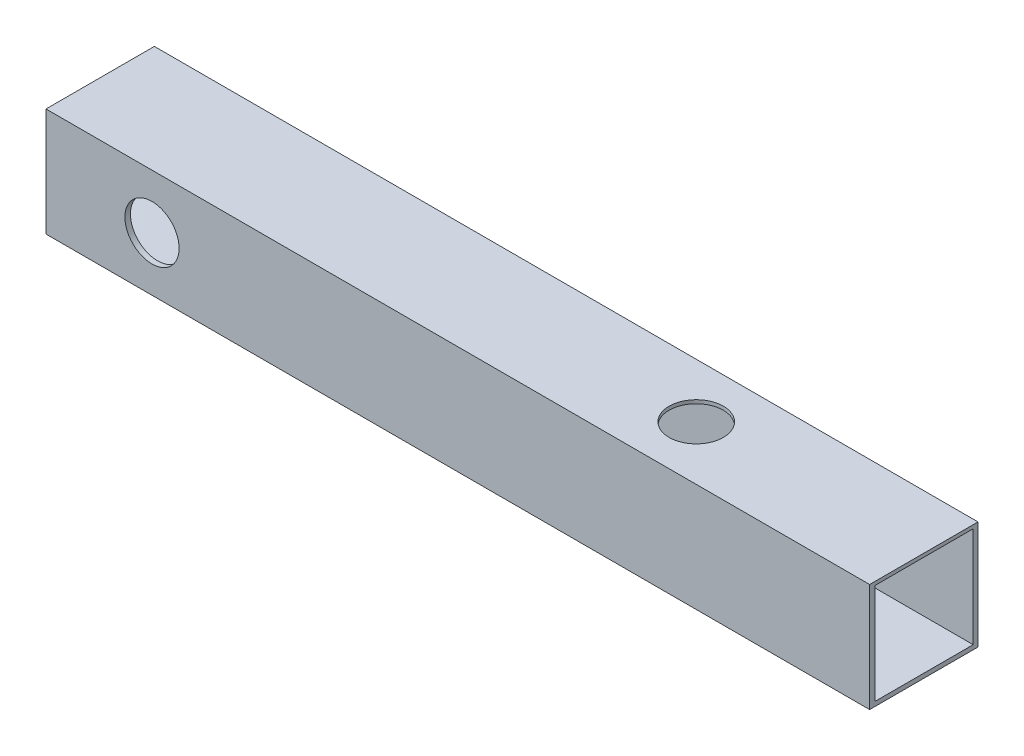
ISO-10303-21;
HEADER;
FILE_DESCRIPTION(('STEP AP214'),'2;1');
FILE_NAME('part.step','',(''),(''),'','','');
FILE_SCHEMA(('AUTOMOTIVE_DESIGN { 1 0 10303 214 1 1 1 1 }'));
ENDSEC;
DATA;
#1=APPLICATION_CONTEXT('core data for automotive mechanical design processes');
#2=APPLICATION_PROTOCOL_DEFINITION('international standard','automotive_design',2000,#1);
#3=PRODUCT_CONTEXT('',#1,'mechanical');
#4=PRODUCT('Part','Part','',(#3));
#5=PRODUCT_RELATED_PRODUCT_CATEGORY('part','',(#4));
#6=PRODUCT_DEFINITION_FORMATION('','',#4);
#7=PRODUCT_DEFINITION_CONTEXT('part definition',#1,'design');
#8=PRODUCT_DEFINITION('design','',#6,#7);
#9=PRODUCT_DEFINITION_SHAPE('','',#8);
#10=(LENGTH_UNIT() NAMED_UNIT(*) SI_UNIT(.MILLI.,.METRE.));
#11=(NAMED_UNIT(*) PLANE_ANGLE_UNIT() SI_UNIT($,.RADIAN.));
#12=(NAMED_UNIT(*) SI_UNIT($,.STERADIAN.) SOLID_ANGLE_UNIT());
#13=UNCERTAINTY_MEASURE_WITH_UNIT(LENGTH_MEASURE(1.E-05),#10,'distance_accuracy_value','');
#14=(GEOMETRIC_REPRESENTATION_CONTEXT(3) GLOBAL_UNCERTAINTY_ASSIGNED_CONTEXT((#13)) GLOBAL_UNIT_ASSIGNED_CONTEXT((#10,
#11,#12)) REPRESENTATION_CONTEXT('',''));
#15=CARTESIAN_POINT('',(0.,0.,0.));
#16=DIRECTION('',(0.,0.,1.));
#17=DIRECTION('',(1.,0.,0.));
#18=AXIS2_PLACEMENT_3D('',#15,#16,#17);
#19=CARTESIAN_POINT('',(38.,10.,-5.));
#20=DIRECTION('',(-1.,0.,0.));
#21=DIRECTION('',(0.,0.,1.));
#22=AXIS2_PLACEMENT_3D('',#19,#20,#21);
#23=PLANE('',#22);
#24=DIRECTION('',(0.,0.,1.));
#25=VECTOR('',#24,1.);
#26=CARTESIAN_POINT('',(38.,0.410528979839953,-4.55573386053487));
#27=LINE('',#26,#25);
#28=CARTESIAN_POINT('',(38.,0.410528979839953,-4.55573386053487));
#29=VERTEX_POINT('',#28);
#30=CARTESIAN_POINT('',(38.,0.410528979839953,4.49074897210089));
#31=VERTEX_POINT('',#30);
#32=EDGE_CURVE('E115',#29,#31,#27,.T.);
#33=ORIENTED_EDGE('',*,*,#32,.T.);
#34=DIRECTION('',(0.,1.,0.));
#35=VECTOR('',#34,1.);
#36=CARTESIAN_POINT('',(38.,0.410528979839953,4.49074897210089));
#37=LINE('',#36,#35);
#38=CARTESIAN_POINT('',(38.,9.67445186257176,4.49074897210089));
#39=VERTEX_POINT('',#38);
#40=EDGE_CURVE('E108',#31,#39,#37,.T.);
#41=ORIENTED_EDGE('',*,*,#40,.T.);
#42=DIRECTION('',(0.,0.,-1.));
#43=VECTOR('',#42,1.);
#44=CARTESIAN_POINT('',(38.,9.67445186257176,-4.55573386053487));
#45=LINE('',#44,#43);
#46=CARTESIAN_POINT('',(38.,9.67445186257176,-4.55573386053487));
#47=VERTEX_POINT('',#46);
#48=EDGE_CURVE('E118',#39,#47,#45,.T.);
#49=ORIENTED_EDGE('',*,*,#48,.T.);
#50=DIRECTION('',(0.,-1.,0.));
#51=VECTOR('',#50,1.);
#52=CARTESIAN_POINT('',(38.,0.410528979839953,-4.55573386053487));
#53=LINE('',#52,#51);
#54=EDGE_CURVE('E56',#47,#29,#53,.T.);
#55=ORIENTED_EDGE('',*,*,#54,.T.);
#56=EDGE_LOOP('',(#33,#41,#49,#55));
#57=FACE_BOUND('',#56,.T.);
#58=DIRECTION('',(0.,0.,-1.));
#59=VECTOR('',#58,1.);
#60=CARTESIAN_POINT('',(38.,0.,-5.));
#61=LINE('',#60,#59);
#62=CARTESIAN_POINT('',(38.,0.,5.));
#63=VERTEX_POINT('',#62);
#64=CARTESIAN_POINT('',(38.,0.,-5.));
#65=VERTEX_POINT('',#64);
#66=EDGE_CURVE('E151',#63,#65,#61,.T.);
#67=ORIENTED_EDGE('',*,*,#66,.T.);
#68=DIRECTION('',(0.,-1.,0.));
#69=VECTOR('',#68,1.);
#70=CARTESIAN_POINT('',(38.,10.,-5.));
#71=LINE('',#70,#69);
#72=CARTESIAN_POINT('',(38.,10.,-5.));
#73=VERTEX_POINT('',#72);
#74=EDGE_CURVE('E11',#73,#65,#71,.T.);
#75=ORIENTED_EDGE('',*,*,#74,.F.);
#76=DIRECTION('',(0.,0.,-1.));
#77=VECTOR('',#76,1.);
#78=CARTESIAN_POINT('',(38.,10.,-5.));
#79=LINE('',#78,#77);
#80=CARTESIAN_POINT('',(38.,10.,5.));
#81=VERTEX_POINT('',#80);
#82=EDGE_CURVE('E157',#81,#73,#79,.T.);
#83=ORIENTED_EDGE('',*,*,#82,.F.);
#84=DIRECTION('',(0.,-1.,0.));
#85=VECTOR('',#84,1.);
#86=CARTESIAN_POINT('',(38.,10.,5.));
#87=LINE('',#86,#85);
#88=EDGE_CURVE('E171',#81,#63,#87,.T.);
#89=ORIENTED_EDGE('',*,*,#88,.T.);
#90=EDGE_LOOP('',(#67,#75,#83,#89));
#91=FACE_BOUND('',#90,.T.);
#92=ADVANCED_FACE('F39',(#57,#91),#23,.F.);
#93=CARTESIAN_POINT('',(-38.,10.,-5.));
#94=DIRECTION('',(0.,0.,1.));
#95=DIRECTION('',(1.,0.,0.));
#96=AXIS2_PLACEMENT_3D('',#93,#94,#95);
#97=PLANE('',#96);
#98=CARTESIAN_POINT('',(-28.218728933674,5.,-5.));
#99=DIRECTION('',(0.,0.,1.));
#100=DIRECTION('',(1.,0.,0.));
#101=AXIS2_PLACEMENT_3D('',#98,#99,#100);
#102=CIRCLE('',#101,2.5);
#103=CARTESIAN_POINT('',(-25.718728933674,5.,-5.));
#104=VERTEX_POINT('',#103);
#105=EDGE_CURVE('E133',#104,#104,#102,.T.);
#106=ORIENTED_EDGE('',*,*,#105,.T.);
#107=EDGE_LOOP('',(#106));
#108=FACE_BOUND('',#107,.T.);
#109=DIRECTION('',(-1.,0.,0.));
#110=VECTOR('',#109,1.);
#111=CARTESIAN_POINT('',(-38.,0.,-5.));
#112=LINE('',#111,#110);
#113=CARTESIAN_POINT('',(-38.,0.,-5.));
#114=VERTEX_POINT('',#113);
#115=EDGE_CURVE('E175',#65,#114,#112,.T.);
#116=ORIENTED_EDGE('',*,*,#115,.T.);
#117=DIRECTION('',(0.,-1.,0.));
#118=VECTOR('',#117,1.);
#119=CARTESIAN_POINT('',(-38.,10.,-5.));
#120=LINE('',#119,#118);
#121=CARTESIAN_POINT('',(-38.,10.,-5.));
#122=VERTEX_POINT('',#121);
#123=EDGE_CURVE('E48',#122,#114,#120,.T.);
#124=ORIENTED_EDGE('',*,*,#123,.F.);
#125=DIRECTION('',(-1.,0.,0.));
#126=VECTOR('',#125,1.);
#127=CARTESIAN_POINT('',(-38.,10.,-5.));
#128=LINE('',#127,#126);
#129=EDGE_CURVE('E161',#73,#122,#128,.T.);
#130=ORIENTED_EDGE('',*,*,#129,.F.);
#131=ORIENTED_EDGE('',*,*,#74,.T.);
#132=EDGE_LOOP('',(#116,#124,#130,#131));
#133=FACE_BOUND('',#132,.T.);
#134=ADVANCED_FACE('F238',(#108,#133),#97,.F.);
#135=CARTESIAN_POINT('',(-38.,10.,-5.));
#136=DIRECTION('',(1.,0.,0.));
#137=DIRECTION('',(0.,0.,-1.));
#138=AXIS2_PLACEMENT_3D('',#135,#136,#137);
#139=PLANE('',#138);
#140=DIRECTION('',(0.,0.,-1.));
#141=VECTOR('',#140,1.);
#142=CARTESIAN_POINT('',(-38.,9.67445186257176,-4.55573386053487));
#143=LINE('',#142,#141);
#144=CARTESIAN_POINT('',(-38.,9.67445186257176,4.49074897210089));
#145=VERTEX_POINT('',#144);
#146=CARTESIAN_POINT('',(-38.,9.67445186257176,-4.55573386053487));
#147=VERTEX_POINT('',#146);
#148=EDGE_CURVE('E142',#145,#147,#143,.T.);
#149=ORIENTED_EDGE('',*,*,#148,.F.);
#150=DIRECTION('',(0.,1.,0.));
#151=VECTOR('',#150,1.);
#152=CARTESIAN_POINT('',(-38.,0.410528979839953,4.49074897210089));
#153=LINE('',#152,#151);
#154=CARTESIAN_POINT('',(-38.,0.410528979839953,4.49074897210089));
#155=VERTEX_POINT('',#154);
#156=EDGE_CURVE('E64',#155,#145,#153,.T.);
#157=ORIENTED_EDGE('',*,*,#156,.F.);
#158=DIRECTION('',(0.,0.,1.));
#159=VECTOR('',#158,1.);
#160=CARTESIAN_POINT('',(-38.,0.410528979839953,-4.55573386053487));
#161=LINE('',#160,#159);
#162=CARTESIAN_POINT('',(-38.,0.410528979839953,-4.55573386053487));
#163=VERTEX_POINT('',#162);
#164=EDGE_CURVE('E126',#163,#155,#161,.T.);
#165=ORIENTED_EDGE('',*,*,#164,.F.);
#166=DIRECTION('',(0.,-1.,0.));
#167=VECTOR('',#166,1.);
#168=CARTESIAN_POINT('',(-38.,0.410528979839953,-4.55573386053487));
#169=LINE('',#168,#167);
#170=EDGE_CURVE('E130',#147,#163,#169,.T.);
#171=ORIENTED_EDGE('',*,*,#170,.F.);
#172=EDGE_LOOP('',(#149,#157,#165,#171));
#173=FACE_BOUND('',#172,.T.);
#174=DIRECTION('',(0.,0.,1.));
#175=VECTOR('',#174,1.);
#176=CARTESIAN_POINT('',(-38.,0.,-5.));
#177=LINE('',#176,#175);
#178=CARTESIAN_POINT('',(-38.,0.,5.));
#179=VERTEX_POINT('',#178);
#180=EDGE_CURVE('E178',#114,#179,#177,.T.);
#181=ORIENTED_EDGE('',*,*,#180,.T.);
#182=DIRECTION('',(0.,-1.,0.));
#183=VECTOR('',#182,1.);
#184=CARTESIAN_POINT('',(-38.,10.,5.));
#185=LINE('',#184,#183);
#186=CARTESIAN_POINT('',(-38.,10.,5.));
#187=VERTEX_POINT('',#186);
#188=EDGE_CURVE('E186',#187,#179,#185,.T.);
#189=ORIENTED_EDGE('',*,*,#188,.F.);
#190=DIRECTION('',(0.,0.,1.));
#191=VECTOR('',#190,1.);
#192=CARTESIAN_POINT('',(-38.,10.,-5.));
#193=LINE('',#192,#191);
#194=EDGE_CURVE('E165',#122,#187,#193,.T.);
#195=ORIENTED_EDGE('',*,*,#194,.F.);
#196=ORIENTED_EDGE('',*,*,#123,.T.);
#197=EDGE_LOOP('',(#181,#189,#195,#196));
#198=FACE_BOUND('',#197,.T.);
#199=ADVANCED_FACE('F242',(#173,#198),#139,.F.);
#200=CARTESIAN_POINT('',(-38.,10.,5.));
#201=DIRECTION('',(0.,0.,-1.));
#202=DIRECTION('',(-1.,0.,0.));
#203=AXIS2_PLACEMENT_3D('',#200,#201,#202);
#204=PLANE('',#203);
#205=CARTESIAN_POINT('',(-28.218728933674,5.,5.));
#206=DIRECTION('',(0.,0.,1.));
#207=DIRECTION('',(1.,0.,0.));
#208=AXIS2_PLACEMENT_3D('',#205,#206,#207);
#209=CIRCLE('',#208,2.5);
#210=CARTESIAN_POINT('',(-25.718728933674,5.,5.));
#211=VERTEX_POINT('',#210);
#212=EDGE_CURVE('E196',#211,#211,#209,.T.);
#213=ORIENTED_EDGE('',*,*,#212,.F.);
#214=EDGE_LOOP('',(#213));
#215=FACE_BOUND('',#214,.T.);
#216=DIRECTION('',(1.,0.,0.));
#217=VECTOR('',#216,1.);
#218=CARTESIAN_POINT('',(-38.,0.,5.));
#219=LINE('',#218,#217);
#220=EDGE_CURVE('E162',#179,#63,#219,.T.);
#221=ORIENTED_EDGE('',*,*,#220,.T.);
#222=ORIENTED_EDGE('',*,*,#88,.F.);
#223=DIRECTION('',(1.,0.,0.));
#224=VECTOR('',#223,1.);
#225=CARTESIAN_POINT('',(-38.,10.,5.));
#226=LINE('',#225,#224);
#227=EDGE_CURVE('E168',#187,#81,#226,.T.);
#228=ORIENTED_EDGE('',*,*,#227,.F.);
#229=ORIENTED_EDGE('',*,*,#188,.T.);
#230=EDGE_LOOP('',(#221,#222,#228,#229));
#231=FACE_BOUND('',#230,.T.);
#232=ADVANCED_FACE('F247',(#215,#231),#204,.F.);
#233=CARTESIAN_POINT('',(0.,10.,0.));
#234=DIRECTION('',(0.,1.,0.));
#235=DIRECTION('',(0.,0.,1.));
#236=AXIS2_PLACEMENT_3D('',#233,#234,#235);
#237=PLANE('',#236);
#238=CARTESIAN_POINT('',(17.,10.,0.));
#239=DIRECTION('',(0.,1.,0.));
#240=DIRECTION('',(0.,0.,1.));
#241=AXIS2_PLACEMENT_3D('',#238,#239,#240);
#242=CIRCLE('',#241,2.5);
#243=CARTESIAN_POINT('',(17.,10.,2.5));
#244=VERTEX_POINT('',#243);
#245=EDGE_CURVE('E215',#244,#244,#242,.T.);
#246=ORIENTED_EDGE('',*,*,#245,.F.);
#247=EDGE_LOOP('',(#246));
#248=FACE_BOUND('',#247,.T.);
#249=ORIENTED_EDGE('',*,*,#82,.T.);
#250=ORIENTED_EDGE('',*,*,#129,.T.);
#251=ORIENTED_EDGE('',*,*,#194,.T.);
#252=ORIENTED_EDGE('',*,*,#227,.T.);
#253=EDGE_LOOP('',(#249,#250,#251,#252));
#254=FACE_BOUND('',#253,.T.);
#255=ADVANCED_FACE('F255',(#248,#254),#237,.T.);
#256=CARTESIAN_POINT('',(0.,0.,0.));
#257=DIRECTION('',(0.,1.,0.));
#258=DIRECTION('',(0.,0.,1.));
#259=AXIS2_PLACEMENT_3D('',#256,#257,#258);
#260=PLANE('',#259);
#261=CARTESIAN_POINT('',(17.,0.,0.));
#262=DIRECTION('',(0.,1.,0.));
#263=DIRECTION('',(0.,0.,1.));
#264=AXIS2_PLACEMENT_3D('',#261,#262,#263);
#265=CIRCLE('',#264,2.5);
#266=CARTESIAN_POINT('',(17.,0.,2.5));
#267=VERTEX_POINT('',#266);
#268=EDGE_CURVE('E203',#267,#267,#265,.T.);
#269=ORIENTED_EDGE('',*,*,#268,.T.);
#270=EDGE_LOOP('',(#269));
#271=FACE_BOUND('',#270,.T.);
#272=ORIENTED_EDGE('',*,*,#66,.F.);
#273=ORIENTED_EDGE('',*,*,#220,.F.);
#274=ORIENTED_EDGE('',*,*,#180,.F.);
#275=ORIENTED_EDGE('',*,*,#115,.F.);
#276=EDGE_LOOP('',(#272,#273,#274,#275));
#277=FACE_BOUND('',#276,.T.);
#278=ADVANCED_FACE('F257',(#271,#277),#260,.F.);
#279=CARTESIAN_POINT('',(38.,0.410528979839953,4.49074897210089));
#280=DIRECTION('',(0.,0.,1.));
#281=DIRECTION('',(1.,0.,0.));
#282=AXIS2_PLACEMENT_3D('',#279,#280,#281);
#283=PLANE('',#282);
#284=CARTESIAN_POINT('',(-28.218728933674,5.,4.49074897210089));
#285=DIRECTION('',(0.,0.,1.));
#286=DIRECTION('',(1.,0.,0.));
#287=AXIS2_PLACEMENT_3D('',#284,#285,#286);
#288=CIRCLE('',#287,2.5);
#289=CARTESIAN_POINT('',(-25.718728933674,5.,4.49074897210089));
#290=VERTEX_POINT('',#289);
#291=EDGE_CURVE('E195',#290,#290,#288,.T.);
#292=ORIENTED_EDGE('',*,*,#291,.T.);
#293=EDGE_LOOP('',(#292));
#294=FACE_BOUND('',#293,.T.);
#295=ORIENTED_EDGE('',*,*,#156,.T.);
#296=DIRECTION('',(-1.,0.,0.));
#297=VECTOR('',#296,1.);
#298=CARTESIAN_POINT('',(38.,9.67445186257176,4.49074897210089));
#299=LINE('',#298,#297);
#300=EDGE_CURVE('E104',#39,#145,#299,.T.);
#301=ORIENTED_EDGE('',*,*,#300,.F.);
#302=ORIENTED_EDGE('',*,*,#40,.F.);
#303=DIRECTION('',(-1.,0.,0.));
#304=VECTOR('',#303,1.);
#305=CARTESIAN_POINT('',(38.,0.410528979839953,4.49074897210089));
#306=LINE('',#305,#304);
#307=EDGE_CURVE('E148',#31,#155,#306,.T.);
#308=ORIENTED_EDGE('',*,*,#307,.T.);
#309=EDGE_LOOP('',(#295,#301,#302,#308));
#310=FACE_BOUND('',#309,.T.);
#311=ADVANCED_FACE('F106',(#294,#310),#283,.F.);
#312=CARTESIAN_POINT('',(38.,0.410528979839953,-4.55573386053487));
#313=DIRECTION('',(0.,-1.,0.));
#314=DIRECTION('',(0.,0.,-1.));
#315=AXIS2_PLACEMENT_3D('',#312,#313,#314);
#316=PLANE('',#315);
#317=CARTESIAN_POINT('',(17.,0.410528979839953,0.));
#318=DIRECTION('',(0.,-1.,0.));
#319=DIRECTION('',(0.,0.,-1.));
#320=AXIS2_PLACEMENT_3D('',#317,#318,#319);
#321=CIRCLE('',#320,2.5);
#322=CARTESIAN_POINT('',(17.,0.410528979839953,-2.5));
#323=VERTEX_POINT('',#322);
#324=EDGE_CURVE('E209',#323,#323,#321,.T.);
#325=ORIENTED_EDGE('',*,*,#324,.T.);
#326=EDGE_LOOP('',(#325));
#327=FACE_BOUND('',#326,.T.);
#328=ORIENTED_EDGE('',*,*,#164,.T.);
#329=ORIENTED_EDGE('',*,*,#307,.F.);
#330=ORIENTED_EDGE('',*,*,#32,.F.);
#331=DIRECTION('',(-1.,0.,0.));
#332=VECTOR('',#331,1.);
#333=CARTESIAN_POINT('',(38.,0.410528979839953,-4.55573386053487));
#334=LINE('',#333,#332);
#335=EDGE_CURVE('E152',#29,#163,#334,.T.);
#336=ORIENTED_EDGE('',*,*,#335,.T.);
#337=EDGE_LOOP('',(#328,#329,#330,#336));
#338=FACE_BOUND('',#337,.T.);
#339=ADVANCED_FACE('F266',(#327,#338),#316,.F.);
#340=CARTESIAN_POINT('',(38.,0.410528979839953,-4.55573386053487));
#341=DIRECTION('',(0.,0.,-1.));
#342=DIRECTION('',(-1.,0.,0.));
#343=AXIS2_PLACEMENT_3D('',#340,#341,#342);
#344=PLANE('',#343);
#345=CARTESIAN_POINT('',(-28.218728933674,5.,-4.55573386053487));
#346=DIRECTION('',(0.,0.,-1.));
#347=DIRECTION('',(-1.,0.,0.));
#348=AXIS2_PLACEMENT_3D('',#345,#346,#347);
#349=CIRCLE('',#348,2.5);
#350=CARTESIAN_POINT('',(-30.718728933674,5.,-4.55573386053487));
#351=VERTEX_POINT('',#350);
#352=EDGE_CURVE('E192',#351,#351,#349,.T.);
#353=ORIENTED_EDGE('',*,*,#352,.T.);
#354=EDGE_LOOP('',(#353));
#355=FACE_BOUND('',#354,.T.);
#356=ORIENTED_EDGE('',*,*,#170,.T.);
#357=ORIENTED_EDGE('',*,*,#335,.F.);
#358=ORIENTED_EDGE('',*,*,#54,.F.);
#359=DIRECTION('',(-1.,0.,0.));
#360=VECTOR('',#359,1.);
#361=CARTESIAN_POINT('',(38.,9.67445186257176,-4.55573386053487));
#362=LINE('',#361,#360);
#363=EDGE_CURVE('E114',#47,#147,#362,.T.);
#364=ORIENTED_EDGE('',*,*,#363,.T.);
#365=EDGE_LOOP('',(#356,#357,#358,#364));
#366=FACE_BOUND('',#365,.T.);
#367=ADVANCED_FACE('F270',(#355,#366),#344,.F.);
#368=CARTESIAN_POINT('',(38.,9.67445186257176,-4.55573386053487));
#369=DIRECTION('',(0.,1.,0.));
#370=DIRECTION('',(0.,0.,1.));
#371=AXIS2_PLACEMENT_3D('',#368,#369,#370);
#372=PLANE('',#371);
#373=CARTESIAN_POINT('',(17.,9.67445186257176,0.));
#374=DIRECTION('',(0.,1.,0.));
#375=DIRECTION('',(0.,0.,1.));
#376=AXIS2_PLACEMENT_3D('',#373,#374,#375);
#377=CIRCLE('',#376,2.5);
#378=CARTESIAN_POINT('',(17.,9.67445186257176,2.5));
#379=VERTEX_POINT('',#378);
#380=EDGE_CURVE('E42',#379,#379,#377,.T.);
#381=ORIENTED_EDGE('',*,*,#380,.T.);
#382=EDGE_LOOP('',(#381));
#383=FACE_BOUND('',#382,.T.);
#384=ORIENTED_EDGE('',*,*,#148,.T.);
#385=ORIENTED_EDGE('',*,*,#363,.F.);
#386=ORIENTED_EDGE('',*,*,#48,.F.);
#387=ORIENTED_EDGE('',*,*,#300,.T.);
#388=EDGE_LOOP('',(#384,#385,#386,#387));
#389=FACE_BOUND('',#388,.T.);
#390=ADVANCED_FACE('F119',(#383,#389),#372,.F.);
#391=CARTESIAN_POINT('',(-28.218728933674,5.,-71.));
#392=DIRECTION('',(0.,0.,1.));
#393=DIRECTION('',(1.,0.,0.));
#394=AXIS2_PLACEMENT_3D('',#391,#392,#393);
#395=CYLINDRICAL_SURFACE('',#394,2.5);
#396=ORIENTED_EDGE('',*,*,#352,.F.);
#397=EDGE_LOOP('',(#396));
#398=FACE_BOUND('',#397,.T.);
#399=ORIENTED_EDGE('',*,*,#105,.F.);
#400=EDGE_LOOP('',(#399));
#401=FACE_BOUND('',#400,.T.);
#402=ADVANCED_FACE('F235',(#398,#401),#395,.F.);
#403=ORIENTED_EDGE('',*,*,#212,.T.);
#404=EDGE_LOOP('',(#403));
#405=FACE_BOUND('',#404,.T.);
#406=ORIENTED_EDGE('',*,*,#291,.F.);
#407=EDGE_LOOP('',(#406));
#408=FACE_BOUND('',#407,.T.);
#409=ADVANCED_FACE('F228',(#405,#408),#395,.F.);
#410=CARTESIAN_POINT('',(17.,-66.,0.));
#411=DIRECTION('',(0.,1.,0.));
#412=DIRECTION('',(0.,0.,1.));
#413=AXIS2_PLACEMENT_3D('',#410,#411,#412);
#414=CYLINDRICAL_SURFACE('',#413,2.5);
#415=ORIENTED_EDGE('',*,*,#245,.T.);
#416=EDGE_LOOP('',(#415));
#417=FACE_BOUND('',#416,.T.);
#418=ORIENTED_EDGE('',*,*,#380,.F.);
#419=EDGE_LOOP('',(#418));
#420=FACE_BOUND('',#419,.T.);
#421=ADVANCED_FACE('F225',(#417,#420),#414,.F.);
#422=ORIENTED_EDGE('',*,*,#324,.F.);
#423=EDGE_LOOP('',(#422));
#424=FACE_BOUND('',#423,.T.);
#425=ORIENTED_EDGE('',*,*,#268,.F.);
#426=EDGE_LOOP('',(#425));
#427=FACE_BOUND('',#426,.T.);
#428=ADVANCED_FACE('F227',(#424,#427),#414,.F.);
#429=CLOSED_SHELL('',(#92,#134,#199,#232,#255,#278,#311,#339,#367,#390,#402,#409,#421,#428));
#430=MANIFOLD_SOLID_BREP('B2',#429);
#431=ADVANCED_BREP_SHAPE_REPRESENTATION('',(#18,#430),#14);
#432=SHAPE_DEFINITION_REPRESENTATION(#9,#431);
ENDSEC;
END-ISO-10303-21;
